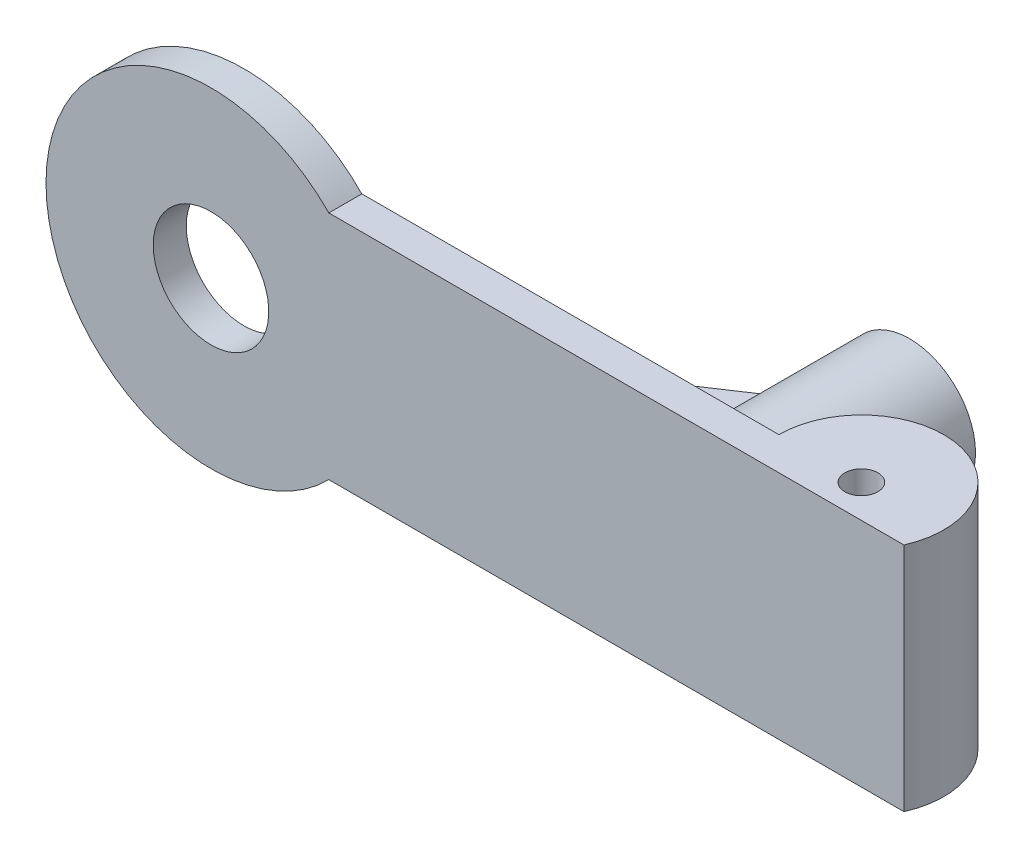
ISO-10303-21;
HEADER;
FILE_DESCRIPTION(('STEP AP214'),'2;1');
FILE_NAME('part.step','',(''),(''),'','','');
FILE_SCHEMA(('AUTOMOTIVE_DESIGN { 1 0 10303 214 1 1 1 1 }'));
ENDSEC;
DATA;
#1=APPLICATION_CONTEXT('core data for automotive mechanical design processes');
#2=APPLICATION_PROTOCOL_DEFINITION('international standard','automotive_design',2000,#1);
#3=PRODUCT_CONTEXT('',#1,'mechanical');
#4=PRODUCT('Part','Part','',(#3));
#5=PRODUCT_RELATED_PRODUCT_CATEGORY('part','',(#4));
#6=PRODUCT_DEFINITION_FORMATION('','',#4);
#7=PRODUCT_DEFINITION_CONTEXT('part definition',#1,'design');
#8=PRODUCT_DEFINITION('design','',#6,#7);
#9=PRODUCT_DEFINITION_SHAPE('','',#8);
#10=(LENGTH_UNIT() NAMED_UNIT(*) SI_UNIT(.MILLI.,.METRE.));
#11=(NAMED_UNIT(*) PLANE_ANGLE_UNIT() SI_UNIT($,.RADIAN.));
#12=(NAMED_UNIT(*) SI_UNIT($,.STERADIAN.) SOLID_ANGLE_UNIT());
#13=UNCERTAINTY_MEASURE_WITH_UNIT(LENGTH_MEASURE(1.E-05),#10,'distance_accuracy_value','');
#14=(GEOMETRIC_REPRESENTATION_CONTEXT(3) GLOBAL_UNCERTAINTY_ASSIGNED_CONTEXT((#13)) GLOBAL_UNIT_ASSIGNED_CONTEXT((#10,
#11,#12)) REPRESENTATION_CONTEXT('',''));
#15=CARTESIAN_POINT('',(0.,0.,0.));
#16=DIRECTION('',(0.,0.,1.));
#17=DIRECTION('',(1.,0.,0.));
#18=AXIS2_PLACEMENT_3D('',#15,#16,#17);
#19=CARTESIAN_POINT('',(-125.408590069593,40.,0.));
#20=DIRECTION('',(0.554700196225229,0.,0.832050294337844));
#21=DIRECTION('',(0.832050294337844,0.,-0.554700196225229));
#22=AXIS2_PLACEMENT_3D('',#19,#20,#21);
#23=PLANE('',#22);
#24=DIRECTION('',(-0.832050294337844,0.,0.554700196225229));
#25=VECTOR('',#24,1.);
#26=CARTESIAN_POINT('',(-125.408590069593,30.,0.));
#27=LINE('',#26,#25);
#28=CARTESIAN_POINT('',(-65.4085900695927,30.,-40.));
#29=VERTEX_POINT('',#28);
#30=CARTESIAN_POINT('',(-125.408590069593,30.,0.));
#31=VERTEX_POINT('',#30);
#32=EDGE_CURVE('E90',#29,#31,#27,.T.);
#33=ORIENTED_EDGE('',*,*,#32,.T.);
#34=DIRECTION('',(0.,-1.,0.));
#35=VECTOR('',#34,1.);
#36=CARTESIAN_POINT('',(-125.408590069593,40.,0.));
#37=LINE('',#36,#35);
#38=CARTESIAN_POINT('',(-125.408590069593,40.,0.));
#39=VERTEX_POINT('',#38);
#40=EDGE_CURVE('E12',#39,#31,#37,.T.);
#41=ORIENTED_EDGE('',*,*,#40,.F.);
#42=DIRECTION('',(-0.832050294337844,0.,0.554700196225229));
#43=VECTOR('',#42,1.);
#44=CARTESIAN_POINT('',(-125.408590069593,40.,0.));
#45=LINE('',#44,#43);
#46=CARTESIAN_POINT('',(-65.4085900695927,40.,-40.));
#47=VERTEX_POINT('',#46);
#48=EDGE_CURVE('E83',#47,#39,#45,.T.);
#49=ORIENTED_EDGE('',*,*,#48,.F.);
#50=DIRECTION('',(0.,-1.,0.));
#51=VECTOR('',#50,1.);
#52=CARTESIAN_POINT('',(-65.4085900695927,40.,-40.));
#53=LINE('',#52,#51);
#54=EDGE_CURVE('E91',#47,#29,#53,.T.);
#55=ORIENTED_EDGE('',*,*,#54,.T.);
#56=EDGE_LOOP('',(#33,#41,#49,#55));
#57=FACE_BOUND('',#56,.T.);
#58=ADVANCED_FACE('F43',(#57),#23,.F.);
#59=CARTESIAN_POINT('',(-65.4085900695927,40.,0.));
#60=DIRECTION('',(0.,0.,-1.));
#61=DIRECTION('',(-1.,0.,0.));
#62=AXIS2_PLACEMENT_3D('',#59,#60,#61);
#63=PLANE('',#62);
#64=DIRECTION('',(1.,0.,0.));
#65=VECTOR('',#64,1.);
#66=CARTESIAN_POINT('',(-65.4085900695927,30.,0.));
#67=LINE('',#66,#65);
#68=CARTESIAN_POINT('',(-65.4085900695927,30.,0.));
#69=VERTEX_POINT('',#68);
#70=EDGE_CURVE('E71',#31,#69,#67,.T.);
#71=ORIENTED_EDGE('',*,*,#70,.T.);
#72=DIRECTION('',(0.,-1.,0.));
#73=VECTOR('',#72,1.);
#74=CARTESIAN_POINT('',(-65.4085900695927,40.,0.));
#75=LINE('',#74,#73);
#76=CARTESIAN_POINT('',(-65.4085900695927,40.,0.));
#77=VERTEX_POINT('',#76);
#78=EDGE_CURVE('E51',#77,#69,#75,.T.);
#79=ORIENTED_EDGE('',*,*,#78,.F.);
#80=DIRECTION('',(1.,0.,0.));
#81=VECTOR('',#80,1.);
#82=CARTESIAN_POINT('',(-65.4085900695927,40.,0.));
#83=LINE('',#82,#81);
#84=EDGE_CURVE('E79',#39,#77,#83,.T.);
#85=ORIENTED_EDGE('',*,*,#84,.F.);
#86=ORIENTED_EDGE('',*,*,#40,.T.);
#87=EDGE_LOOP('',(#71,#79,#85,#86));
#88=FACE_BOUND('',#87,.T.);
#89=ADVANCED_FACE('F80',(#88),#63,.F.);
#90=CARTESIAN_POINT('',(-65.4085900695927,40.,-40.));
#91=DIRECTION('',(-1.,0.,0.));
#92=DIRECTION('',(0.,0.,1.));
#93=AXIS2_PLACEMENT_3D('',#90,#91,#92);
#94=PLANE('',#93);
#95=DIRECTION('',(0.,0.,-1.));
#96=VECTOR('',#95,1.);
#97=CARTESIAN_POINT('',(-65.4085900695927,30.,-40.));
#98=LINE('',#97,#96);
#99=EDGE_CURVE('E76',#69,#29,#98,.T.);
#100=ORIENTED_EDGE('',*,*,#99,.T.);
#101=ORIENTED_EDGE('',*,*,#54,.F.);
#102=DIRECTION('',(0.,0.,-1.));
#103=VECTOR('',#102,1.);
#104=CARTESIAN_POINT('',(-65.4085900695927,40.,-40.));
#105=LINE('',#104,#103);
#106=EDGE_CURVE('E59',#77,#47,#105,.T.);
#107=ORIENTED_EDGE('',*,*,#106,.F.);
#108=ORIENTED_EDGE('',*,*,#78,.T.);
#109=EDGE_LOOP('',(#100,#101,#107,#108));
#110=FACE_BOUND('',#109,.T.);
#111=ADVANCED_FACE('F98',(#110),#94,.F.);
#112=CARTESIAN_POINT('',(0.,40.,0.));
#113=DIRECTION('',(0.,-1.,0.));
#114=DIRECTION('',(0.,0.,-1.));
#115=AXIS2_PLACEMENT_3D('',#112,#113,#114);
#116=PLANE('',#115);
#117=ORIENTED_EDGE('',*,*,#48,.T.);
#118=ORIENTED_EDGE('',*,*,#84,.T.);
#119=ORIENTED_EDGE('',*,*,#106,.T.);
#120=EDGE_LOOP('',(#117,#118,#119));
#121=FACE_BOUND('',#120,.T.);
#122=ADVANCED_FACE('F86',(#121),#116,.F.);
#123=CARTESIAN_POINT('',(0.,30.,0.));
#124=DIRECTION('',(0.,-1.,0.));
#125=DIRECTION('',(0.,0.,-1.));
#126=AXIS2_PLACEMENT_3D('',#123,#124,#125);
#127=PLANE('',#126);
#128=ORIENTED_EDGE('',*,*,#32,.F.);
#129=ORIENTED_EDGE('',*,*,#99,.F.);
#130=ORIENTED_EDGE('',*,*,#70,.F.);
#131=EDGE_LOOP('',(#128,#129,#130));
#132=FACE_BOUND('',#131,.T.);
#133=ADVANCED_FACE('F99',(#132),#127,.T.);
#134=CLOSED_SHELL('',(#58,#89,#111,#122,#133));
#135=MANIFOLD_SOLID_BREP('B2',#134);
#136=CARTESIAN_POINT('',(0.,70.,0.));
#137=DIRECTION('',(0.,1.,0.));
#138=DIRECTION('',(0.,0.,1.));
#139=AXIS2_PLACEMENT_3D('',#136,#137,#138);
#140=PLANE('',#139);
#141=DIRECTION('',(0.,0.,-1.));
#142=VECTOR('',#141,1.);
#143=CARTESIAN_POINT('',(-151.379979382507,70.,10.));
#144=LINE('',#143,#142);
#145=CARTESIAN_POINT('',(-151.379979382507,70.,10.));
#146=VERTEX_POINT('',#145);
#147=CARTESIAN_POINT('',(-151.379979382507,70.,0.));
#148=VERTEX_POINT('',#147);
#149=EDGE_CURVE('E212',#146,#148,#144,.T.);
#150=ORIENTED_EDGE('',*,*,#149,.F.);
#151=DIRECTION('',(1.,0.,0.));
#152=VECTOR('',#151,1.);
#153=CARTESIAN_POINT('',(-187.087121525221,70.,10.));
#154=LINE('',#153,#152);
#155=CARTESIAN_POINT('',(22.9128784747792,70.,10.));
#156=VERTEX_POINT('',#155);
#157=EDGE_CURVE('E187',#146,#156,#154,.T.);
#158=ORIENTED_EDGE('',*,*,#157,.T.);
#159=CARTESIAN_POINT('',(0.,70.,0.));
#160=DIRECTION('',(0.,1.,0.));
#161=DIRECTION('',(0.,0.,1.));
#162=AXIS2_PLACEMENT_3D('',#159,#160,#161);
#163=CIRCLE('',#162,25.);
#164=CARTESIAN_POINT('',(-25.,70.,0.));
#165=VERTEX_POINT('',#164);
#166=EDGE_CURVE('E188',#156,#165,#163,.T.);
#167=ORIENTED_EDGE('',*,*,#166,.T.);
#168=DIRECTION('',(-1.,0.,0.));
#169=VECTOR('',#168,1.);
#170=CARTESIAN_POINT('',(-25.,70.,0.));
#171=LINE('',#170,#169);
#172=EDGE_CURVE('E156',#165,#148,#171,.T.);
#173=ORIENTED_EDGE('',*,*,#172,.T.);
#174=EDGE_LOOP('',(#150,#158,#167,#173));
#175=FACE_BOUND('',#174,.T.);
#176=CARTESIAN_POINT('',(0.,70.,0.));
#177=DIRECTION('',(0.,1.,0.));
#178=DIRECTION('',(0.,0.,1.));
#179=AXIS2_PLACEMENT_3D('',#176,#177,#178);
#180=CIRCLE('',#179,5.);
#181=CARTESIAN_POINT('',(0.,70.,5.));
#182=VERTEX_POINT('',#181);
#183=EDGE_CURVE('E207',#182,#182,#180,.T.);
#184=ORIENTED_EDGE('',*,*,#183,.F.);
#185=EDGE_LOOP('',(#184));
#186=FACE_BOUND('',#185,.T.);
#187=ADVANCED_FACE('F141',(#175,#186),#140,.T.);
#188=CARTESIAN_POINT('',(0.,0.,0.));
#189=DIRECTION('',(0.,1.,0.));
#190=DIRECTION('',(0.,0.,1.));
#191=AXIS2_PLACEMENT_3D('',#188,#189,#190);
#192=PLANE('',#191);
#193=DIRECTION('',(1.,0.,0.));
#194=VECTOR('',#193,1.);
#195=CARTESIAN_POINT('',(-187.087121525221,0.,10.));
#196=LINE('',#195,#194);
#197=CARTESIAN_POINT('',(-151.379979382507,0.,10.));
#198=VERTEX_POINT('',#197);
#199=CARTESIAN_POINT('',(22.9128784747792,0.,10.));
#200=VERTEX_POINT('',#199);
#201=EDGE_CURVE('E196',#198,#200,#196,.T.);
#202=ORIENTED_EDGE('',*,*,#201,.F.);
#203=DIRECTION('',(0.,0.,-1.));
#204=VECTOR('',#203,1.);
#205=CARTESIAN_POINT('',(-151.379979382507,0.,10.));
#206=LINE('',#205,#204);
#207=CARTESIAN_POINT('',(-151.379979382507,0.,0.));
#208=VERTEX_POINT('',#207);
#209=EDGE_CURVE('E164',#198,#208,#206,.T.);
#210=ORIENTED_EDGE('',*,*,#209,.T.);
#211=DIRECTION('',(-1.,0.,0.));
#212=VECTOR('',#211,1.);
#213=CARTESIAN_POINT('',(-25.,0.,0.));
#214=LINE('',#213,#212);
#215=CARTESIAN_POINT('',(-25.,0.,0.));
#216=VERTEX_POINT('',#215);
#217=EDGE_CURVE('E204',#216,#208,#214,.T.);
#218=ORIENTED_EDGE('',*,*,#217,.F.);
#219=CARTESIAN_POINT('',(0.,0.,0.));
#220=DIRECTION('',(0.,1.,0.));
#221=DIRECTION('',(0.,0.,1.));
#222=AXIS2_PLACEMENT_3D('',#219,#220,#221);
#223=CIRCLE('',#222,25.);
#224=EDGE_CURVE('E199',#200,#216,#223,.T.);
#225=ORIENTED_EDGE('',*,*,#224,.F.);
#226=EDGE_LOOP('',(#202,#210,#218,#225));
#227=FACE_BOUND('',#226,.T.);
#228=CARTESIAN_POINT('',(0.,0.,0.));
#229=DIRECTION('',(0.,1.,0.));
#230=DIRECTION('',(0.,0.,1.));
#231=AXIS2_PLACEMENT_3D('',#228,#229,#230);
#232=CIRCLE('',#231,5.);
#233=CARTESIAN_POINT('',(0.,0.,5.));
#234=VERTEX_POINT('',#233);
#235=EDGE_CURVE('E209',#234,#234,#232,.T.);
#236=ORIENTED_EDGE('',*,*,#235,.T.);
#237=EDGE_LOOP('',(#236));
#238=FACE_BOUND('',#237,.T.);
#239=ADVANCED_FACE('F257',(#227,#238),#192,.F.);
#240=CARTESIAN_POINT('',(0.,70.,0.));
#241=DIRECTION('',(0.,-1.,0.));
#242=DIRECTION('',(0.,0.,-1.));
#243=AXIS2_PLACEMENT_3D('',#240,#241,#242);
#244=CYLINDRICAL_SURFACE('',#243,25.);
#245=ORIENTED_EDGE('',*,*,#224,.T.);
#246=DIRECTION('',(0.,-1.,0.));
#247=VECTOR('',#246,1.);
#248=CARTESIAN_POINT('',(-25.,70.,0.));
#249=LINE('',#248,#247);
#250=EDGE_CURVE('E149',#165,#216,#249,.T.);
#251=ORIENTED_EDGE('',*,*,#250,.F.);
#252=ORIENTED_EDGE('',*,*,#166,.F.);
#253=DIRECTION('',(0.,-1.,0.));
#254=VECTOR('',#253,1.);
#255=CARTESIAN_POINT('',(22.9128784747792,70.,10.));
#256=LINE('',#255,#254);
#257=EDGE_CURVE('E200',#156,#200,#256,.T.);
#258=ORIENTED_EDGE('',*,*,#257,.T.);
#259=EDGE_LOOP('',(#245,#251,#252,#258));
#260=FACE_BOUND('',#259,.T.);
#261=ADVANCED_FACE('F143',(#260),#244,.T.);
#262=CARTESIAN_POINT('',(-25.,70.,0.));
#263=DIRECTION('',(0.,0.,1.));
#264=DIRECTION('',(1.,0.,0.));
#265=AXIS2_PLACEMENT_3D('',#262,#263,#264);
#266=PLANE('',#265);
#267=CARTESIAN_POINT('',(-45.4085900695927,35.,0.));
#268=DIRECTION('',(0.,0.,1.));
#269=DIRECTION('',(1.,0.,0.));
#270=AXIS2_PLACEMENT_3D('',#267,#268,#269);
#271=CIRCLE('',#270,20.);
#272=CARTESIAN_POINT('',(-25.4085900695927,35.,0.));
#273=VERTEX_POINT('',#272);
#274=EDGE_CURVE('E41',#273,#273,#271,.F.);
#275=ORIENTED_EDGE('',*,*,#274,.F.);
#276=EDGE_LOOP('',(#275));
#277=FACE_BOUND('',#276,.T.);
#278=CARTESIAN_POINT('',(-187.087121525221,35.,0.));
#279=DIRECTION('',(0.,0.,-1.));
#280=DIRECTION('',(-1.,0.,0.));
#281=AXIS2_PLACEMENT_3D('',#278,#279,#280);
#282=CIRCLE('',#281,17.5);
#283=CARTESIAN_POINT('',(-204.587121525221,35.,0.));
#284=VERTEX_POINT('',#283);
#285=EDGE_CURVE('E222',#284,#284,#282,.T.);
#286=ORIENTED_EDGE('',*,*,#285,.F.);
#287=EDGE_LOOP('',(#286));
#288=FACE_BOUND('',#287,.T.);
#289=ORIENTED_EDGE('',*,*,#217,.T.);
#290=CARTESIAN_POINT('',(-187.087121525221,35.,0.));
#291=DIRECTION('',(0.,0.,-1.));
#292=DIRECTION('',(-1.,0.,0.));
#293=AXIS2_PLACEMENT_3D('',#290,#291,#292);
#294=CIRCLE('',#293,50.);
#295=EDGE_CURVE('E186',#208,#148,#294,.T.);
#296=ORIENTED_EDGE('',*,*,#295,.T.);
#297=ORIENTED_EDGE('',*,*,#172,.F.);
#298=ORIENTED_EDGE('',*,*,#250,.T.);
#299=EDGE_LOOP('',(#289,#296,#297,#298));
#300=FACE_BOUND('',#299,.T.);
#301=ADVANCED_FACE('F182',(#277,#288,#300),#266,.F.);
#302=CARTESIAN_POINT('',(-187.087121525221,70.,10.));
#303=DIRECTION('',(0.,0.,-1.));
#304=DIRECTION('',(-1.,0.,0.));
#305=AXIS2_PLACEMENT_3D('',#302,#303,#304);
#306=PLANE('',#305);
#307=CARTESIAN_POINT('',(-187.087121525221,35.,10.));
#308=DIRECTION('',(0.,0.,-1.));
#309=DIRECTION('',(-1.,0.,0.));
#310=AXIS2_PLACEMENT_3D('',#307,#308,#309);
#311=CIRCLE('',#310,17.5);
#312=CARTESIAN_POINT('',(-204.587121525221,35.,10.));
#313=VERTEX_POINT('',#312);
#314=EDGE_CURVE('E219',#313,#313,#311,.T.);
#315=ORIENTED_EDGE('',*,*,#314,.T.);
#316=EDGE_LOOP('',(#315));
#317=FACE_BOUND('',#316,.T.);
#318=ORIENTED_EDGE('',*,*,#157,.F.);
#319=CARTESIAN_POINT('',(-187.087121525221,35.,10.));
#320=DIRECTION('',(0.,0.,-1.));
#321=DIRECTION('',(-1.,0.,0.));
#322=AXIS2_PLACEMENT_3D('',#319,#320,#321);
#323=CIRCLE('',#322,50.);
#324=EDGE_CURVE('E217',#198,#146,#323,.T.);
#325=ORIENTED_EDGE('',*,*,#324,.F.);
#326=ORIENTED_EDGE('',*,*,#201,.T.);
#327=ORIENTED_EDGE('',*,*,#257,.F.);
#328=EDGE_LOOP('',(#318,#325,#326,#327));
#329=FACE_BOUND('',#328,.T.);
#330=ADVANCED_FACE('F267',(#317,#329),#306,.F.);
#331=CARTESIAN_POINT('',(0.,70.,0.));
#332=DIRECTION('',(0.,-1.,0.));
#333=DIRECTION('',(0.,0.,-1.));
#334=AXIS2_PLACEMENT_3D('',#331,#332,#333);
#335=CYLINDRICAL_SURFACE('',#334,5.);
#336=ORIENTED_EDGE('',*,*,#183,.T.);
#337=EDGE_LOOP('',(#336));
#338=FACE_BOUND('',#337,.T.);
#339=ORIENTED_EDGE('',*,*,#235,.F.);
#340=EDGE_LOOP('',(#339));
#341=FACE_BOUND('',#340,.T.);
#342=ADVANCED_FACE('F264',(#338,#341),#335,.F.);
#343=CARTESIAN_POINT('',(-187.087121525221,35.,10.));
#344=DIRECTION('',(0.,0.,-1.));
#345=DIRECTION('',(-1.,0.,0.));
#346=AXIS2_PLACEMENT_3D('',#343,#344,#345);
#347=CYLINDRICAL_SURFACE('',#346,50.);
#348=ORIENTED_EDGE('',*,*,#324,.T.);
#349=ORIENTED_EDGE('',*,*,#149,.T.);
#350=ORIENTED_EDGE('',*,*,#295,.F.);
#351=ORIENTED_EDGE('',*,*,#209,.F.);
#352=EDGE_LOOP('',(#348,#349,#350,#351));
#353=FACE_BOUND('',#352,.T.);
#354=ADVANCED_FACE('F252',(#353),#347,.T.);
#355=CARTESIAN_POINT('',(-187.087121525221,35.,10.));
#356=DIRECTION('',(0.,0.,-1.));
#357=DIRECTION('',(-1.,0.,0.));
#358=AXIS2_PLACEMENT_3D('',#355,#356,#357);
#359=CYLINDRICAL_SURFACE('',#358,17.5);
#360=ORIENTED_EDGE('',*,*,#314,.F.);
#361=EDGE_LOOP('',(#360));
#362=FACE_BOUND('',#361,.T.);
#363=ORIENTED_EDGE('',*,*,#285,.T.);
#364=EDGE_LOOP('',(#363));
#365=FACE_BOUND('',#364,.T.);
#366=ADVANCED_FACE('F243',(#362,#365),#359,.F.);
#367=CARTESIAN_POINT('',(-45.4085900695927,35.,-60.));
#368=DIRECTION('',(0.,0.,-1.));
#369=DIRECTION('',(-1.,0.,0.));
#370=AXIS2_PLACEMENT_3D('',#367,#368,#369);
#371=PLANE('',#370);
#372=CARTESIAN_POINT('',(-45.4085900695927,35.,-60.));
#373=DIRECTION('',(0.,0.,-1.));
#374=DIRECTION('',(-1.,0.,0.));
#375=AXIS2_PLACEMENT_3D('',#372,#373,#374);
#376=CIRCLE('',#375,20.);
#377=CARTESIAN_POINT('',(-65.4085900695927,35.,-60.));
#378=VERTEX_POINT('',#377);
#379=EDGE_CURVE('E225',#378,#378,#376,.T.);
#380=ORIENTED_EDGE('',*,*,#379,.T.);
#381=EDGE_LOOP('',(#380));
#382=FACE_BOUND('',#381,.T.);
#383=CARTESIAN_POINT('',(-45.4085900695927,35.,-60.));
#384=DIRECTION('',(0.,0.,-1.));
#385=DIRECTION('',(-1.,0.,0.));
#386=AXIS2_PLACEMENT_3D('',#383,#384,#385);
#387=CIRCLE('',#386,7.5);
#388=CARTESIAN_POINT('',(-52.9085900695927,35.,-60.));
#389=VERTEX_POINT('',#388);
#390=EDGE_CURVE('E230',#389,#389,#387,.T.);
#391=ORIENTED_EDGE('',*,*,#390,.F.);
#392=EDGE_LOOP('',(#391));
#393=FACE_BOUND('',#392,.T.);
#394=ADVANCED_FACE('F240',(#382,#393),#371,.T.);
#395=CARTESIAN_POINT('',(-45.4085900695927,35.,-60.));
#396=DIRECTION('',(0.,0.,1.));
#397=DIRECTION('',(1.,0.,0.));
#398=AXIS2_PLACEMENT_3D('',#395,#396,#397);
#399=CYLINDRICAL_SURFACE('',#398,20.);
#400=ORIENTED_EDGE('',*,*,#379,.F.);
#401=EDGE_LOOP('',(#400));
#402=FACE_BOUND('',#401,.T.);
#403=ORIENTED_EDGE('',*,*,#274,.T.);
#404=EDGE_LOOP('',(#403));
#405=FACE_BOUND('',#404,.T.);
#406=ADVANCED_FACE('F242',(#402,#405),#399,.T.);
#407=CARTESIAN_POINT('',(-45.4085900695927,35.,-60.));
#408=DIRECTION('',(0.,0.,1.));
#409=DIRECTION('',(1.,0.,0.));
#410=AXIS2_PLACEMENT_3D('',#407,#408,#409);
#411=CYLINDRICAL_SURFACE('',#410,7.5);
#412=ORIENTED_EDGE('',*,*,#390,.T.);
#413=EDGE_LOOP('',(#412));
#414=FACE_BOUND('',#413,.T.);
#415=CARTESIAN_POINT('',(-45.4085900695927,35.,0.));
#416=DIRECTION('',(0.,0.,-1.));
#417=DIRECTION('',(-1.,0.,0.));
#418=AXIS2_PLACEMENT_3D('',#415,#416,#417);
#419=CIRCLE('',#418,7.5);
#420=CARTESIAN_POINT('',(-52.9085900695927,35.,0.));
#421=VERTEX_POINT('',#420);
#422=EDGE_CURVE('E231',#421,#421,#419,.T.);
#423=ORIENTED_EDGE('',*,*,#422,.F.);
#424=EDGE_LOOP('',(#423));
#425=FACE_BOUND('',#424,.T.);
#426=ADVANCED_FACE('F237',(#414,#425),#411,.F.);
#427=ORIENTED_EDGE('',*,*,#422,.T.);
#428=EDGE_LOOP('',(#427));
#429=FACE_BOUND('',#428,.T.);
#430=ADVANCED_FACE('F272',(#429),#266,.F.);
#431=CLOSED_SHELL('',(#187,#239,#261,#301,#330,#342,#354,#366,#394,#406,#426,#430));
#432=MANIFOLD_SOLID_BREP('B6',#431);
#433=ADVANCED_BREP_SHAPE_REPRESENTATION('',(#18,#135,#432),#14);
#434=SHAPE_DEFINITION_REPRESENTATION(#9,#433);
ENDSEC;
END-ISO-10303-21;
